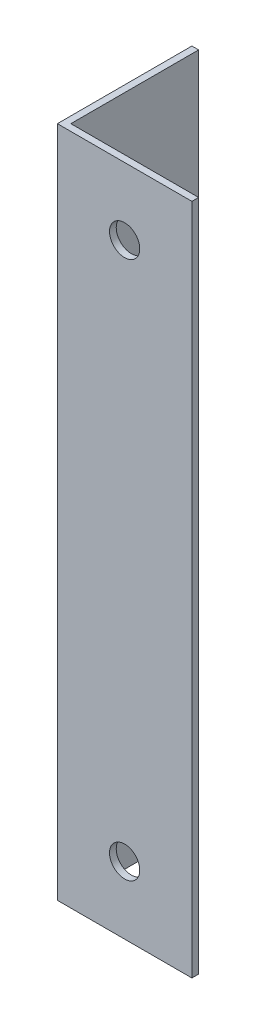
ISO-10303-21;
HEADER;
FILE_DESCRIPTION(('STEP AP214'),'2;1');
FILE_NAME('part.step','',(''),(''),'','','');
FILE_SCHEMA(('AUTOMOTIVE_DESIGN { 1 0 10303 214 1 1 1 1 }'));
ENDSEC;
DATA;
#1=APPLICATION_CONTEXT('core data for automotive mechanical design processes');
#2=APPLICATION_PROTOCOL_DEFINITION('international standard','automotive_design',2000,#1);
#3=PRODUCT_CONTEXT('',#1,'mechanical');
#4=PRODUCT('Part','Part','',(#3));
#5=PRODUCT_RELATED_PRODUCT_CATEGORY('part','',(#4));
#6=PRODUCT_DEFINITION_FORMATION('','',#4);
#7=PRODUCT_DEFINITION_CONTEXT('part definition',#1,'design');
#8=PRODUCT_DEFINITION('design','',#6,#7);
#9=PRODUCT_DEFINITION_SHAPE('','',#8);
#10=(LENGTH_UNIT() NAMED_UNIT(*) SI_UNIT(.MILLI.,.METRE.));
#11=(NAMED_UNIT(*) PLANE_ANGLE_UNIT() SI_UNIT($,.RADIAN.));
#12=(NAMED_UNIT(*) SI_UNIT($,.STERADIAN.) SOLID_ANGLE_UNIT());
#13=UNCERTAINTY_MEASURE_WITH_UNIT(LENGTH_MEASURE(1.E-05),#10,'distance_accuracy_value','');
#14=(GEOMETRIC_REPRESENTATION_CONTEXT(3) GLOBAL_UNCERTAINTY_ASSIGNED_CONTEXT((#13)) GLOBAL_UNIT_ASSIGNED_CONTEXT((#10,
#11,#12)) REPRESENTATION_CONTEXT('',''));
#15=CARTESIAN_POINT('',(0.,0.,0.));
#16=DIRECTION('',(0.,0.,1.));
#17=DIRECTION('',(1.,0.,0.));
#18=AXIS2_PLACEMENT_3D('',#15,#16,#17);
#19=CARTESIAN_POINT('',(20.,100.,0.));
#20=DIRECTION('',(0.,0.,-1.));
#21=DIRECTION('',(-1.,0.,0.));
#22=AXIS2_PLACEMENT_3D('',#19,#20,#21);
#23=PLANE('',#22);
#24=CARTESIAN_POINT('',(9.99999999999998,90.,0.));
#25=DIRECTION('',(0.,0.,-1.));
#26=DIRECTION('',(-1.,0.,0.));
#27=AXIS2_PLACEMENT_3D('',#24,#25,#26);
#28=CIRCLE('',#27,2.25);
#29=CARTESIAN_POINT('',(7.74999999999998,90.,0.));
#30=VERTEX_POINT('',#29);
#31=EDGE_CURVE('E175',#30,#30,#28,.T.);
#32=ORIENTED_EDGE('',*,*,#31,.T.);
#33=EDGE_LOOP('',(#32));
#34=FACE_BOUND('',#33,.T.);
#35=CARTESIAN_POINT('',(10.,10.,0.));
#36=DIRECTION('',(0.,0.,-1.));
#37=DIRECTION('',(-1.,0.,0.));
#38=AXIS2_PLACEMENT_3D('',#35,#36,#37);
#39=CIRCLE('',#38,2.25);
#40=CARTESIAN_POINT('',(7.75000000000001,10.,0.));
#41=VERTEX_POINT('',#40);
#42=EDGE_CURVE('E134',#41,#41,#39,.T.);
#43=ORIENTED_EDGE('',*,*,#42,.T.);
#44=EDGE_LOOP('',(#43));
#45=FACE_BOUND('',#44,.T.);
#46=DIRECTION('',(1.,0.,0.));
#47=VECTOR('',#46,1.);
#48=CARTESIAN_POINT('',(20.,0.,0.));
#49=LINE('',#48,#47);
#50=CARTESIAN_POINT('',(0.,0.,0.));
#51=VERTEX_POINT('',#50);
#52=CARTESIAN_POINT('',(20.,0.,0.));
#53=VERTEX_POINT('',#52);
#54=EDGE_CURVE('E130',#51,#53,#49,.T.);
#55=ORIENTED_EDGE('',*,*,#54,.T.);
#56=DIRECTION('',(0.,-1.,0.));
#57=VECTOR('',#56,1.);
#58=CARTESIAN_POINT('',(20.,100.,0.));
#59=LINE('',#58,#57);
#60=CARTESIAN_POINT('',(20.,100.,0.));
#61=VERTEX_POINT('',#60);
#62=EDGE_CURVE('E13',#61,#53,#59,.T.);
#63=ORIENTED_EDGE('',*,*,#62,.F.);
#64=DIRECTION('',(1.,0.,0.));
#65=VECTOR('',#64,1.);
#66=CARTESIAN_POINT('',(20.,100.,0.));
#67=LINE('',#66,#65);
#68=CARTESIAN_POINT('',(0.,100.,0.));
#69=VERTEX_POINT('',#68);
#70=EDGE_CURVE('E141',#69,#61,#67,.T.);
#71=ORIENTED_EDGE('',*,*,#70,.F.);
#72=DIRECTION('',(0.,-1.,0.));
#73=VECTOR('',#72,1.);
#74=CARTESIAN_POINT('',(0.,100.,0.));
#75=LINE('',#74,#73);
#76=EDGE_CURVE('E126',#69,#51,#75,.T.);
#77=ORIENTED_EDGE('',*,*,#76,.T.);
#78=EDGE_LOOP('',(#55,#63,#71,#77));
#79=FACE_BOUND('',#78,.T.);
#80=ADVANCED_FACE('F46',(#34,#45,#79),#23,.F.);
#81=CARTESIAN_POINT('',(20.,100.,-1.));
#82=DIRECTION('',(-1.,0.,0.));
#83=DIRECTION('',(0.,0.,1.));
#84=AXIS2_PLACEMENT_3D('',#81,#82,#83);
#85=PLANE('',#84);
#86=DIRECTION('',(0.,0.,-1.));
#87=VECTOR('',#86,1.);
#88=CARTESIAN_POINT('',(20.,0.,-1.));
#89=LINE('',#88,#87);
#90=CARTESIAN_POINT('',(20.,0.,-1.));
#91=VERTEX_POINT('',#90);
#92=EDGE_CURVE('E133',#53,#91,#89,.T.);
#93=ORIENTED_EDGE('',*,*,#92,.T.);
#94=DIRECTION('',(0.,-1.,0.));
#95=VECTOR('',#94,1.);
#96=CARTESIAN_POINT('',(20.,100.,-1.));
#97=LINE('',#96,#95);
#98=CARTESIAN_POINT('',(20.,100.,-1.));
#99=VERTEX_POINT('',#98);
#100=EDGE_CURVE('E54',#99,#91,#97,.T.);
#101=ORIENTED_EDGE('',*,*,#100,.F.);
#102=DIRECTION('',(0.,0.,-1.));
#103=VECTOR('',#102,1.);
#104=CARTESIAN_POINT('',(20.,100.,-1.));
#105=LINE('',#104,#103);
#106=EDGE_CURVE('E99',#61,#99,#105,.T.);
#107=ORIENTED_EDGE('',*,*,#106,.F.);
#108=ORIENTED_EDGE('',*,*,#62,.T.);
#109=EDGE_LOOP('',(#93,#101,#107,#108));
#110=FACE_BOUND('',#109,.T.);
#111=ADVANCED_FACE('F167',(#110),#85,.F.);
#112=CARTESIAN_POINT('',(1.,100.,-1.));
#113=DIRECTION('',(0.,0.,1.));
#114=DIRECTION('',(1.,0.,0.));
#115=AXIS2_PLACEMENT_3D('',#112,#113,#114);
#116=PLANE('',#115);
#117=CARTESIAN_POINT('',(9.99999999999998,90.,-0.999999999999973));
#118=DIRECTION('',(0.,0.,-1.));
#119=DIRECTION('',(-1.,0.,0.));
#120=AXIS2_PLACEMENT_3D('',#117,#118,#119);
#121=CIRCLE('',#120,2.25);
#122=CARTESIAN_POINT('',(7.74999999999998,90.,-0.999999999999973));
#123=VERTEX_POINT('',#122);
#124=EDGE_CURVE('E184',#123,#123,#121,.T.);
#125=ORIENTED_EDGE('',*,*,#124,.F.);
#126=EDGE_LOOP('',(#125));
#127=FACE_BOUND('',#126,.T.);
#128=CARTESIAN_POINT('',(10.,10.,-0.999999999999973));
#129=DIRECTION('',(0.,0.,-1.));
#130=DIRECTION('',(-1.,0.,0.));
#131=AXIS2_PLACEMENT_3D('',#128,#129,#130);
#132=CIRCLE('',#131,2.25);
#133=CARTESIAN_POINT('',(7.75000000000001,10.,-0.999999999999973));
#134=VERTEX_POINT('',#133);
#135=EDGE_CURVE('E179',#134,#134,#132,.T.);
#136=ORIENTED_EDGE('',*,*,#135,.F.);
#137=EDGE_LOOP('',(#136));
#138=FACE_BOUND('',#137,.T.);
#139=DIRECTION('',(-1.,0.,0.));
#140=VECTOR('',#139,1.);
#141=CARTESIAN_POINT('',(1.,0.,-1.));
#142=LINE('',#141,#140);
#143=CARTESIAN_POINT('',(1.,0.,-1.));
#144=VERTEX_POINT('',#143);
#145=EDGE_CURVE('E136',#91,#144,#142,.T.);
#146=ORIENTED_EDGE('',*,*,#145,.T.);
#147=DIRECTION('',(0.,-1.,0.));
#148=VECTOR('',#147,1.);
#149=CARTESIAN_POINT('',(1.,100.,-1.));
#150=LINE('',#149,#148);
#151=CARTESIAN_POINT('',(1.,100.,-1.));
#152=VERTEX_POINT('',#151);
#153=EDGE_CURVE('E121',#152,#144,#150,.T.);
#154=ORIENTED_EDGE('',*,*,#153,.F.);
#155=DIRECTION('',(-1.,0.,0.));
#156=VECTOR('',#155,1.);
#157=CARTESIAN_POINT('',(1.,100.,-1.));
#158=LINE('',#157,#156);
#159=EDGE_CURVE('E112',#99,#152,#158,.T.);
#160=ORIENTED_EDGE('',*,*,#159,.F.);
#161=ORIENTED_EDGE('',*,*,#100,.T.);
#162=EDGE_LOOP('',(#146,#154,#160,#161));
#163=FACE_BOUND('',#162,.T.);
#164=ADVANCED_FACE('F147',(#127,#138,#163),#116,.F.);
#165=CARTESIAN_POINT('',(1.,100.,-20.));
#166=DIRECTION('',(-1.,0.,0.));
#167=DIRECTION('',(0.,0.,1.));
#168=AXIS2_PLACEMENT_3D('',#165,#166,#167);
#169=PLANE('',#168);
#170=CARTESIAN_POINT('',(0.999999999999973,9.50000000000001,-10.5));
#171=DIRECTION('',(1.,0.,0.));
#172=DIRECTION('',(0.,0.,-1.));
#173=AXIS2_PLACEMENT_3D('',#170,#171,#172);
#174=CIRCLE('',#173,2.25);
#175=CARTESIAN_POINT('',(0.999999999999973,9.50000000000001,-12.75));
#176=VERTEX_POINT('',#175);
#177=EDGE_CURVE('E191',#176,#176,#174,.T.);
#178=ORIENTED_EDGE('',*,*,#177,.F.);
#179=EDGE_LOOP('',(#178));
#180=FACE_BOUND('',#179,.T.);
#181=DIRECTION('',(0.,0.,-1.));
#182=VECTOR('',#181,1.);
#183=CARTESIAN_POINT('',(1.,0.,-20.));
#184=LINE('',#183,#182);
#185=CARTESIAN_POINT('',(1.,0.,-20.));
#186=VERTEX_POINT('',#185);
#187=EDGE_CURVE('E120',#144,#186,#184,.T.);
#188=ORIENTED_EDGE('',*,*,#187,.T.);
#189=DIRECTION('',(0.,-1.,0.));
#190=VECTOR('',#189,1.);
#191=CARTESIAN_POINT('',(1.,100.,-20.));
#192=LINE('',#191,#190);
#193=CARTESIAN_POINT('',(1.,100.,-20.));
#194=VERTEX_POINT('',#193);
#195=EDGE_CURVE('E117',#194,#186,#192,.T.);
#196=ORIENTED_EDGE('',*,*,#195,.F.);
#197=DIRECTION('',(0.,0.,-1.));
#198=VECTOR('',#197,1.);
#199=CARTESIAN_POINT('',(1.,100.,-20.));
#200=LINE('',#199,#198);
#201=EDGE_CURVE('E106',#152,#194,#200,.T.);
#202=ORIENTED_EDGE('',*,*,#201,.F.);
#203=ORIENTED_EDGE('',*,*,#153,.T.);
#204=EDGE_LOOP('',(#188,#196,#202,#203));
#205=FACE_BOUND('',#204,.T.);
#206=ADVANCED_FACE('F118',(#180,#205),#169,.F.);
#207=CARTESIAN_POINT('',(0.,100.,-20.));
#208=DIRECTION('',(0.,0.,1.));
#209=DIRECTION('',(1.,0.,0.));
#210=AXIS2_PLACEMENT_3D('',#207,#208,#209);
#211=PLANE('',#210);
#212=DIRECTION('',(-1.,0.,0.));
#213=VECTOR('',#212,1.);
#214=CARTESIAN_POINT('',(0.,0.,-20.));
#215=LINE('',#214,#213);
#216=CARTESIAN_POINT('',(0.,0.,-20.));
#217=VERTEX_POINT('',#216);
#218=EDGE_CURVE('E85',#186,#217,#215,.T.);
#219=ORIENTED_EDGE('',*,*,#218,.T.);
#220=DIRECTION('',(0.,-1.,0.));
#221=VECTOR('',#220,1.);
#222=CARTESIAN_POINT('',(0.,100.,-20.));
#223=LINE('',#222,#221);
#224=CARTESIAN_POINT('',(0.,100.,-20.));
#225=VERTEX_POINT('',#224);
#226=EDGE_CURVE('E122',#225,#217,#223,.T.);
#227=ORIENTED_EDGE('',*,*,#226,.F.);
#228=DIRECTION('',(-1.,0.,0.));
#229=VECTOR('',#228,1.);
#230=CARTESIAN_POINT('',(0.,100.,-20.));
#231=LINE('',#230,#229);
#232=EDGE_CURVE('E110',#194,#225,#231,.T.);
#233=ORIENTED_EDGE('',*,*,#232,.F.);
#234=ORIENTED_EDGE('',*,*,#195,.T.);
#235=EDGE_LOOP('',(#219,#227,#233,#234));
#236=FACE_BOUND('',#235,.T.);
#237=ADVANCED_FACE('F124',(#236),#211,.F.);
#238=CARTESIAN_POINT('',(0.,100.,0.));
#239=DIRECTION('',(1.,0.,0.));
#240=DIRECTION('',(0.,0.,-1.));
#241=AXIS2_PLACEMENT_3D('',#238,#239,#240);
#242=PLANE('',#241);
#243=CARTESIAN_POINT('',(0.,9.50000000000001,-10.5));
#244=DIRECTION('',(1.,0.,0.));
#245=DIRECTION('',(0.,0.,-1.));
#246=AXIS2_PLACEMENT_3D('',#243,#244,#245);
#247=CIRCLE('',#246,2.25);
#248=CARTESIAN_POINT('',(0.,9.50000000000001,-12.75));
#249=VERTEX_POINT('',#248);
#250=EDGE_CURVE('E189',#249,#249,#247,.T.);
#251=ORIENTED_EDGE('',*,*,#250,.T.);
#252=EDGE_LOOP('',(#251));
#253=FACE_BOUND('',#252,.T.);
#254=DIRECTION('',(0.,0.,1.));
#255=VECTOR('',#254,1.);
#256=CARTESIAN_POINT('',(0.,0.,0.));
#257=LINE('',#256,#255);
#258=EDGE_CURVE('E91',#217,#51,#257,.T.);
#259=ORIENTED_EDGE('',*,*,#258,.T.);
#260=ORIENTED_EDGE('',*,*,#76,.F.);
#261=DIRECTION('',(0.,0.,1.));
#262=VECTOR('',#261,1.);
#263=CARTESIAN_POINT('',(0.,100.,0.));
#264=LINE('',#263,#262);
#265=EDGE_CURVE('E62',#225,#69,#264,.T.);
#266=ORIENTED_EDGE('',*,*,#265,.F.);
#267=ORIENTED_EDGE('',*,*,#226,.T.);
#268=EDGE_LOOP('',(#259,#260,#266,#267));
#269=FACE_BOUND('',#268,.T.);
#270=ADVANCED_FACE('F154',(#253,#269),#242,.F.);
#271=CARTESIAN_POINT('',(0.,100.,0.));
#272=DIRECTION('',(0.,-1.,0.));
#273=DIRECTION('',(0.,0.,-1.));
#274=AXIS2_PLACEMENT_3D('',#271,#272,#273);
#275=PLANE('',#274);
#276=ORIENTED_EDGE('',*,*,#70,.T.);
#277=ORIENTED_EDGE('',*,*,#106,.T.);
#278=ORIENTED_EDGE('',*,*,#159,.T.);
#279=ORIENTED_EDGE('',*,*,#201,.T.);
#280=ORIENTED_EDGE('',*,*,#232,.T.);
#281=ORIENTED_EDGE('',*,*,#265,.T.);
#282=EDGE_LOOP('',(#276,#277,#278,#279,#280,#281));
#283=FACE_BOUND('',#282,.T.);
#284=ADVANCED_FACE('F108',(#283),#275,.F.);
#285=CARTESIAN_POINT('',(0.,0.,0.));
#286=DIRECTION('',(0.,-1.,0.));
#287=DIRECTION('',(0.,0.,-1.));
#288=AXIS2_PLACEMENT_3D('',#285,#286,#287);
#289=PLANE('',#288);
#290=ORIENTED_EDGE('',*,*,#54,.F.);
#291=ORIENTED_EDGE('',*,*,#258,.F.);
#292=ORIENTED_EDGE('',*,*,#218,.F.);
#293=ORIENTED_EDGE('',*,*,#187,.F.);
#294=ORIENTED_EDGE('',*,*,#145,.F.);
#295=ORIENTED_EDGE('',*,*,#92,.F.);
#296=EDGE_LOOP('',(#290,#291,#292,#293,#294,#295));
#297=FACE_BOUND('',#296,.T.);
#298=ADVANCED_FACE('F150',(#297),#289,.T.);
#299=CARTESIAN_POINT('',(10.,10.,0.));
#300=DIRECTION('',(0.,0.,-1.));
#301=DIRECTION('',(-1.,0.,0.));
#302=AXIS2_PLACEMENT_3D('',#299,#300,#301);
#303=CYLINDRICAL_SURFACE('',#302,2.25);
#304=ORIENTED_EDGE('',*,*,#42,.F.);
#305=EDGE_LOOP('',(#304));
#306=FACE_BOUND('',#305,.T.);
#307=ORIENTED_EDGE('',*,*,#135,.T.);
#308=EDGE_LOOP('',(#307));
#309=FACE_BOUND('',#308,.T.);
#310=ADVANCED_FACE('F216',(#306,#309),#303,.F.);
#311=CARTESIAN_POINT('',(9.99999999999998,90.,0.));
#312=DIRECTION('',(0.,0.,-1.));
#313=DIRECTION('',(-1.,0.,0.));
#314=AXIS2_PLACEMENT_3D('',#311,#312,#313);
#315=CYLINDRICAL_SURFACE('',#314,2.25);
#316=ORIENTED_EDGE('',*,*,#31,.F.);
#317=EDGE_LOOP('',(#316));
#318=FACE_BOUND('',#317,.T.);
#319=ORIENTED_EDGE('',*,*,#124,.T.);
#320=EDGE_LOOP('',(#319));
#321=FACE_BOUND('',#320,.T.);
#322=ADVANCED_FACE('F199',(#318,#321),#315,.F.);
#323=CARTESIAN_POINT('',(0.,9.50000000000001,-10.5));
#324=DIRECTION('',(1.,0.,0.));
#325=DIRECTION('',(0.,0.,-1.));
#326=AXIS2_PLACEMENT_3D('',#323,#324,#325);
#327=CYLINDRICAL_SURFACE('',#326,2.25);
#328=ORIENTED_EDGE('',*,*,#250,.F.);
#329=EDGE_LOOP('',(#328));
#330=FACE_BOUND('',#329,.T.);
#331=ORIENTED_EDGE('',*,*,#177,.T.);
#332=EDGE_LOOP('',(#331));
#333=FACE_BOUND('',#332,.T.);
#334=ADVANCED_FACE('F196',(#330,#333),#327,.F.);
#335=CLOSED_SHELL('',(#80,#111,#164,#206,#237,#270,#284,#298,#310,#322,#334));
#336=MANIFOLD_SOLID_BREP('B2',#335);
#337=ADVANCED_BREP_SHAPE_REPRESENTATION('',(#18,#336),#14);
#338=SHAPE_DEFINITION_REPRESENTATION(#9,#337);
ENDSEC;
END-ISO-10303-21;
